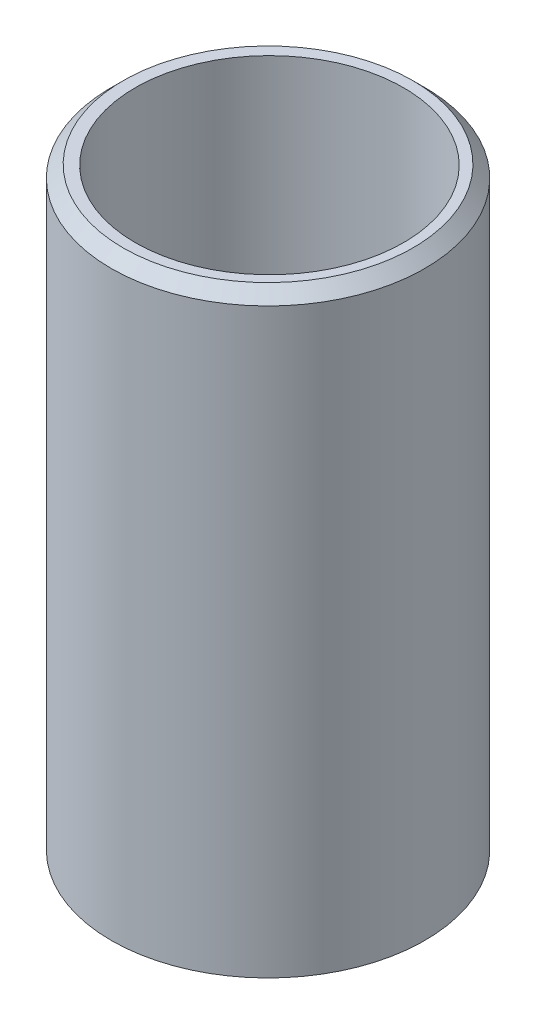
ISO-10303-21;
HEADER;
FILE_DESCRIPTION(('STEP AP214'),'2;1');
FILE_NAME('part.step','',(''),(''),'','','');
FILE_SCHEMA(('AUTOMOTIVE_DESIGN { 1 0 10303 214 1 1 1 1 }'));
ENDSEC;
DATA;
#1=APPLICATION_CONTEXT('core data for automotive mechanical design processes');
#2=APPLICATION_PROTOCOL_DEFINITION('international standard','automotive_design',2000,#1);
#3=PRODUCT_CONTEXT('',#1,'mechanical');
#4=PRODUCT('Part','Part','',(#3));
#5=PRODUCT_RELATED_PRODUCT_CATEGORY('part','',(#4));
#6=PRODUCT_DEFINITION_FORMATION('','',#4);
#7=PRODUCT_DEFINITION_CONTEXT('part definition',#1,'design');
#8=PRODUCT_DEFINITION('design','',#6,#7);
#9=PRODUCT_DEFINITION_SHAPE('','',#8);
#10=(LENGTH_UNIT() NAMED_UNIT(*) SI_UNIT(.MILLI.,.METRE.));
#11=(NAMED_UNIT(*) PLANE_ANGLE_UNIT() SI_UNIT($,.RADIAN.));
#12=(NAMED_UNIT(*) SI_UNIT($,.STERADIAN.) SOLID_ANGLE_UNIT());
#13=UNCERTAINTY_MEASURE_WITH_UNIT(LENGTH_MEASURE(1.E-05),#10,'distance_accuracy_value','');
#14=(GEOMETRIC_REPRESENTATION_CONTEXT(3) GLOBAL_UNCERTAINTY_ASSIGNED_CONTEXT((#13)) GLOBAL_UNIT_ASSIGNED_CONTEXT((#10,
#11,#12)) REPRESENTATION_CONTEXT('',''));
#15=CARTESIAN_POINT('',(0.,0.,0.));
#16=DIRECTION('',(0.,0.,1.));
#17=DIRECTION('',(1.,0.,0.));
#18=AXIS2_PLACEMENT_3D('',#15,#16,#17);
#19=CARTESIAN_POINT('',(-13.4146377800926,63.5,-13.2880845934879));
#20=DIRECTION('',(0.,-1.,0.));
#21=DIRECTION('',(0.,0.,-1.));
#22=AXIS2_PLACEMENT_3D('',#19,#20,#21);
#23=CYLINDRICAL_SURFACE('',#22,16.764);
#24=CARTESIAN_POINT('',(-13.4146377800926,62.23,-13.2880845934879));
#25=DIRECTION('',(0.,1.,0.));
#26=DIRECTION('',(0.,0.,1.));
#27=AXIS2_PLACEMENT_3D('',#24,#25,#26);
#28=CIRCLE('',#27,16.764);
#29=CARTESIAN_POINT('',(-13.4146377800926,62.23,3.47591540651206));
#30=VERTEX_POINT('',#29);
#31=EDGE_CURVE('E10',#30,#30,#28,.F.);
#32=ORIENTED_EDGE('',*,*,#31,.T.);
#33=EDGE_LOOP('',(#32));
#34=FACE_BOUND('',#33,.T.);
#35=CARTESIAN_POINT('',(-13.4146377800926,0.,-13.2880845934879));
#36=DIRECTION('',(0.,1.,0.));
#37=DIRECTION('',(0.,0.,1.));
#38=AXIS2_PLACEMENT_3D('',#35,#36,#37);
#39=CIRCLE('',#38,16.764);
#40=CARTESIAN_POINT('',(-13.4146377800926,0.,3.47591540651206));
#41=VERTEX_POINT('',#40);
#42=EDGE_CURVE('E57',#41,#41,#39,.T.);
#43=ORIENTED_EDGE('',*,*,#42,.T.);
#44=EDGE_LOOP('',(#43));
#45=FACE_BOUND('',#44,.T.);
#46=ADVANCED_FACE('F43',(#34,#45),#23,.T.);
#47=CARTESIAN_POINT('',(-13.4146377800926,63.5,-13.2880845934879));
#48=DIRECTION('',(0.,1.,0.));
#49=DIRECTION('',(0.,0.,1.));
#50=AXIS2_PLACEMENT_3D('',#47,#48,#49);
#51=PLANE('',#50);
#52=CARTESIAN_POINT('',(-13.4146377800926,63.5,-13.2880845934879));
#53=DIRECTION('',(0.,1.,0.));
#54=DIRECTION('',(0.,0.,1.));
#55=AXIS2_PLACEMENT_3D('',#52,#53,#54);
#56=CIRCLE('',#55,15.494);
#57=CARTESIAN_POINT('',(-13.4146377800926,63.5,2.20591540651204));
#58=VERTEX_POINT('',#57);
#59=EDGE_CURVE('E52',#58,#58,#56,.T.);
#60=ORIENTED_EDGE('',*,*,#59,.T.);
#61=EDGE_LOOP('',(#60));
#62=FACE_BOUND('',#61,.T.);
#63=CARTESIAN_POINT('',(-13.2585764925219,63.5,-13.2780330054655));
#64=DIRECTION('',(0.,1.,0.));
#65=DIRECTION('',(0.,0.,1.));
#66=AXIS2_PLACEMENT_3D('',#63,#64,#65);
#67=CIRCLE('',#66,14.351);
#68=CARTESIAN_POINT('',(-13.2585764925219,63.5,1.07296699453452));
#69=VERTEX_POINT('',#68);
#70=EDGE_CURVE('E62',#69,#69,#67,.F.);
#71=ORIENTED_EDGE('',*,*,#70,.T.);
#72=EDGE_LOOP('',(#71));
#73=FACE_BOUND('',#72,.T.);
#74=ADVANCED_FACE('F85',(#62,#73),#51,.T.);
#75=CARTESIAN_POINT('',(-13.4146377800926,0.,-13.2880845934879));
#76=DIRECTION('',(0.,1.,0.));
#77=DIRECTION('',(0.,0.,1.));
#78=AXIS2_PLACEMENT_3D('',#75,#76,#77);
#79=PLANE('',#78);
#80=CARTESIAN_POINT('',(-13.2585764925219,0.,-13.2780330054655));
#81=DIRECTION('',(0.,1.,0.));
#82=DIRECTION('',(0.,0.,1.));
#83=AXIS2_PLACEMENT_3D('',#80,#81,#82);
#84=CIRCLE('',#83,14.351);
#85=CARTESIAN_POINT('',(-13.2585764925219,0.,1.07296699453452));
#86=VERTEX_POINT('',#85);
#87=EDGE_CURVE('E68',#86,#86,#84,.T.);
#88=ORIENTED_EDGE('',*,*,#87,.T.);
#89=EDGE_LOOP('',(#88));
#90=FACE_BOUND('',#89,.T.);
#91=ORIENTED_EDGE('',*,*,#42,.F.);
#92=EDGE_LOOP('',(#91));
#93=FACE_BOUND('',#92,.T.);
#94=ADVANCED_FACE('F73',(#90,#93),#79,.F.);
#95=CARTESIAN_POINT('',(-13.2585764925219,166.37,-13.2780330054655));
#96=DIRECTION('',(0.,-1.,0.));
#97=DIRECTION('',(0.,0.,-1.));
#98=AXIS2_PLACEMENT_3D('',#95,#96,#97);
#99=CYLINDRICAL_SURFACE('',#98,14.351);
#100=ORIENTED_EDGE('',*,*,#70,.F.);
#101=EDGE_LOOP('',(#100));
#102=FACE_BOUND('',#101,.T.);
#103=ORIENTED_EDGE('',*,*,#87,.F.);
#104=EDGE_LOOP('',(#103));
#105=FACE_BOUND('',#104,.T.);
#106=ADVANCED_FACE('F76',(#102,#105),#99,.F.);
#107=CARTESIAN_POINT('',(-13.4146377800926,63.5,-13.2880845934879));
#108=DIRECTION('',(0.,-1.,0.));
#109=DIRECTION('',(0.,0.,-1.));
#110=AXIS2_PLACEMENT_3D('',#107,#108,#109);
#111=CONICAL_SURFACE('',#110,15.494,0.785398163397451);
#112=ORIENTED_EDGE('',*,*,#31,.F.);
#113=EDGE_LOOP('',(#112));
#114=FACE_BOUND('',#113,.T.);
#115=ORIENTED_EDGE('',*,*,#59,.F.);
#116=EDGE_LOOP('',(#115));
#117=FACE_BOUND('',#116,.T.);
#118=ADVANCED_FACE('F46',(#114,#117),#111,.T.);
#119=CLOSED_SHELL('',(#46,#74,#94,#106,#118));
#120=MANIFOLD_SOLID_BREP('B2',#119);
#121=ADVANCED_BREP_SHAPE_REPRESENTATION('',(#18,#120),#14);
#122=SHAPE_DEFINITION_REPRESENTATION(#9,#121);
ENDSEC;
END-ISO-10303-21;
